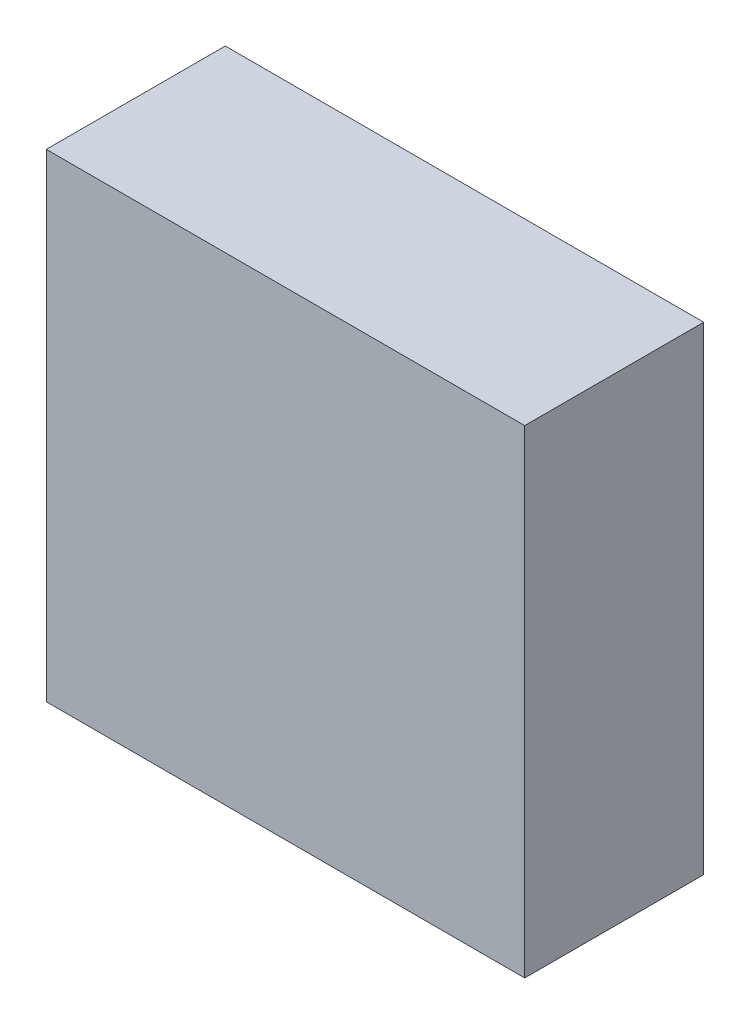
ISO-10303-21;
HEADER;
FILE_DESCRIPTION(('STEP AP214'),'2;1');
FILE_NAME('part.step','',(''),(''),'','','');
FILE_SCHEMA(('AUTOMOTIVE_DESIGN { 1 0 10303 214 1 1 1 1 }'));
ENDSEC;
DATA;
#1=APPLICATION_CONTEXT('core data for automotive mechanical design processes');
#2=APPLICATION_PROTOCOL_DEFINITION('international standard','automotive_design',2000,#1);
#3=PRODUCT_CONTEXT('',#1,'mechanical');
#4=PRODUCT('Part','Part','',(#3));
#5=PRODUCT_RELATED_PRODUCT_CATEGORY('part','',(#4));
#6=PRODUCT_DEFINITION_FORMATION('','',#4);
#7=PRODUCT_DEFINITION_CONTEXT('part definition',#1,'design');
#8=PRODUCT_DEFINITION('design','',#6,#7);
#9=PRODUCT_DEFINITION_SHAPE('','',#8);
#10=(LENGTH_UNIT() NAMED_UNIT(*) SI_UNIT(.MILLI.,.METRE.));
#11=(NAMED_UNIT(*) PLANE_ANGLE_UNIT() SI_UNIT($,.RADIAN.));
#12=(NAMED_UNIT(*) SI_UNIT($,.STERADIAN.) SOLID_ANGLE_UNIT());
#13=UNCERTAINTY_MEASURE_WITH_UNIT(LENGTH_MEASURE(1.E-05),#10,'distance_accuracy_value','');
#14=(GEOMETRIC_REPRESENTATION_CONTEXT(3) GLOBAL_UNCERTAINTY_ASSIGNED_CONTEXT((#13)) GLOBAL_UNIT_ASSIGNED_CONTEXT((#10,
#11,#12)) REPRESENTATION_CONTEXT('',''));
#15=CARTESIAN_POINT('',(0.,0.,0.));
#16=DIRECTION('',(0.,0.,1.));
#17=DIRECTION('',(1.,0.,0.));
#18=AXIS2_PLACEMENT_3D('',#15,#16,#17);
#19=CARTESIAN_POINT('',(-0.7349998,-0.7349998,0.5499989));
#20=DIRECTION('',(0.,0.,-1.));
#21=DIRECTION('',(-1.,0.,0.));
#22=AXIS2_PLACEMENT_3D('',#19,#20,#21);
#23=PLANE('',#22);
#24=DIRECTION('',(0.,1.,0.));
#25=VECTOR('',#24,1.);
#26=CARTESIAN_POINT('',(0.7349998,-0.7349998,0.5499989));
#27=LINE('',#26,#25);
#28=CARTESIAN_POINT('',(0.7349998,-0.7349998,0.5499989));
#29=VERTEX_POINT('',#28);
#30=CARTESIAN_POINT('',(0.7349998,0.7349998,0.5499989));
#31=VERTEX_POINT('',#30);
#32=EDGE_CURVE('E55',#29,#31,#27,.T.);
#33=ORIENTED_EDGE('',*,*,#32,.T.);
#34=DIRECTION('',(1.,0.,0.));
#35=VECTOR('',#34,1.);
#36=CARTESIAN_POINT('',(0.7349998,0.7349998,0.5499989));
#37=LINE('',#36,#35);
#38=CARTESIAN_POINT('',(-0.7349998,0.7349998,0.5499989));
#39=VERTEX_POINT('',#38);
#40=EDGE_CURVE('E57',#31,#39,#37,.F.);
#41=ORIENTED_EDGE('',*,*,#40,.T.);
#42=DIRECTION('',(0.,1.,0.));
#43=VECTOR('',#42,1.);
#44=CARTESIAN_POINT('',(-0.7349998,0.7349998,0.5499989));
#45=LINE('',#44,#43);
#46=CARTESIAN_POINT('',(-0.7349998,-0.7349998,0.5499989));
#47=VERTEX_POINT('',#46);
#48=EDGE_CURVE('E20',#39,#47,#45,.F.);
#49=ORIENTED_EDGE('',*,*,#48,.T.);
#50=DIRECTION('',(1.,0.,0.));
#51=VECTOR('',#50,1.);
#52=CARTESIAN_POINT('',(-0.7349998,-0.7349998,0.5499989));
#53=LINE('',#52,#51);
#54=EDGE_CURVE('E80',#47,#29,#53,.T.);
#55=ORIENTED_EDGE('',*,*,#54,.T.);
#56=EDGE_LOOP('',(#33,#41,#49,#55));
#57=FACE_BOUND('',#56,.T.);
#58=ADVANCED_FACE('F17',(#57),#23,.F.);
#59=CARTESIAN_POINT('',(-0.7349998,0.7349998,0.));
#60=DIRECTION('',(1.,0.,0.));
#61=DIRECTION('',(0.,0.,-1.));
#62=AXIS2_PLACEMENT_3D('',#59,#60,#61);
#63=PLANE('',#62);
#64=DIRECTION('',(0.,0.,1.));
#65=VECTOR('',#64,1.);
#66=CARTESIAN_POINT('',(-0.7349998,-0.7349998,0.));
#67=LINE('',#66,#65);
#68=CARTESIAN_POINT('',(-0.7349998,-0.7349998,0.));
#69=VERTEX_POINT('',#68);
#70=EDGE_CURVE('E68',#69,#47,#67,.T.);
#71=ORIENTED_EDGE('',*,*,#70,.T.);
#72=ORIENTED_EDGE('',*,*,#48,.F.);
#73=DIRECTION('',(0.,0.,-1.));
#74=VECTOR('',#73,1.);
#75=CARTESIAN_POINT('',(-0.7349998,0.7349998,0.));
#76=LINE('',#75,#74);
#77=CARTESIAN_POINT('',(-0.7349998,0.7349998,0.));
#78=VERTEX_POINT('',#77);
#79=EDGE_CURVE('E63',#39,#78,#76,.T.);
#80=ORIENTED_EDGE('',*,*,#79,.T.);
#81=DIRECTION('',(0.,1.,0.));
#82=VECTOR('',#81,1.);
#83=CARTESIAN_POINT('',(-0.7349998,-0.7349998,0.));
#84=LINE('',#83,#82);
#85=EDGE_CURVE('E83',#69,#78,#84,.T.);
#86=ORIENTED_EDGE('',*,*,#85,.F.);
#87=EDGE_LOOP('',(#71,#72,#80,#86));
#88=FACE_BOUND('',#87,.T.);
#89=ADVANCED_FACE('F65',(#88),#63,.F.);
#90=CARTESIAN_POINT('',(0.7349998,0.7349998,0.));
#91=DIRECTION('',(0.,-1.,0.));
#92=DIRECTION('',(0.,0.,-1.));
#93=AXIS2_PLACEMENT_3D('',#90,#91,#92);
#94=PLANE('',#93);
#95=ORIENTED_EDGE('',*,*,#79,.F.);
#96=ORIENTED_EDGE('',*,*,#40,.F.);
#97=DIRECTION('',(0.,0.,1.));
#98=VECTOR('',#97,1.);
#99=CARTESIAN_POINT('',(0.7349998,0.7349998,0.));
#100=LINE('',#99,#98);
#101=CARTESIAN_POINT('',(0.7349998,0.7349998,0.));
#102=VERTEX_POINT('',#101);
#103=EDGE_CURVE('E75',#31,#102,#100,.F.);
#104=ORIENTED_EDGE('',*,*,#103,.T.);
#105=DIRECTION('',(-1.,0.,0.));
#106=VECTOR('',#105,1.);
#107=CARTESIAN_POINT('',(-0.7349998,0.7349998,0.));
#108=LINE('',#107,#106);
#109=EDGE_CURVE('E72',#78,#102,#108,.F.);
#110=ORIENTED_EDGE('',*,*,#109,.F.);
#111=EDGE_LOOP('',(#95,#96,#104,#110));
#112=FACE_BOUND('',#111,.T.);
#113=ADVANCED_FACE('F70',(#112),#94,.F.);
#114=CARTESIAN_POINT('',(0.7349998,-0.7349998,0.));
#115=DIRECTION('',(-1.,0.,0.));
#116=DIRECTION('',(0.,0.,1.));
#117=AXIS2_PLACEMENT_3D('',#114,#115,#116);
#118=PLANE('',#117);
#119=ORIENTED_EDGE('',*,*,#103,.F.);
#120=ORIENTED_EDGE('',*,*,#32,.F.);
#121=DIRECTION('',(0.,0.,1.));
#122=VECTOR('',#121,1.);
#123=CARTESIAN_POINT('',(0.7349998,-0.7349998,0.));
#124=LINE('',#123,#122);
#125=CARTESIAN_POINT('',(0.7349998,-0.7349998,0.));
#126=VERTEX_POINT('',#125);
#127=EDGE_CURVE('E35',#29,#126,#124,.F.);
#128=ORIENTED_EDGE('',*,*,#127,.T.);
#129=DIRECTION('',(0.,1.,0.));
#130=VECTOR('',#129,1.);
#131=CARTESIAN_POINT('',(0.7349998,-0.7349998,0.));
#132=LINE('',#131,#130);
#133=EDGE_CURVE('E26',#102,#126,#132,.F.);
#134=ORIENTED_EDGE('',*,*,#133,.F.);
#135=EDGE_LOOP('',(#119,#120,#128,#134));
#136=FACE_BOUND('',#135,.T.);
#137=ADVANCED_FACE('F89',(#136),#118,.F.);
#138=CARTESIAN_POINT('',(-0.7349998,-0.7349998,0.));
#139=DIRECTION('',(0.,1.,0.));
#140=DIRECTION('',(0.,0.,1.));
#141=AXIS2_PLACEMENT_3D('',#138,#139,#140);
#142=PLANE('',#141);
#143=ORIENTED_EDGE('',*,*,#127,.F.);
#144=ORIENTED_EDGE('',*,*,#54,.F.);
#145=ORIENTED_EDGE('',*,*,#70,.F.);
#146=DIRECTION('',(-1.,0.,0.));
#147=VECTOR('',#146,1.);
#148=CARTESIAN_POINT('',(-0.7349998,-0.7349998,0.));
#149=LINE('',#148,#147);
#150=EDGE_CURVE('E11',#126,#69,#149,.T.);
#151=ORIENTED_EDGE('',*,*,#150,.F.);
#152=EDGE_LOOP('',(#143,#144,#145,#151));
#153=FACE_BOUND('',#152,.T.);
#154=ADVANCED_FACE('F91',(#153),#142,.F.);
#155=CARTESIAN_POINT('',(-0.7349998,-0.7349998,0.));
#156=DIRECTION('',(0.,0.,-1.));
#157=DIRECTION('',(-1.,0.,0.));
#158=AXIS2_PLACEMENT_3D('',#155,#156,#157);
#159=PLANE('',#158);
#160=ORIENTED_EDGE('',*,*,#133,.T.);
#161=ORIENTED_EDGE('',*,*,#150,.T.);
#162=ORIENTED_EDGE('',*,*,#85,.T.);
#163=ORIENTED_EDGE('',*,*,#109,.T.);
#164=EDGE_LOOP('',(#160,#161,#162,#163));
#165=FACE_BOUND('',#164,.T.);
#166=ADVANCED_FACE('F88',(#165),#159,.T.);
#167=CLOSED_SHELL('',(#58,#89,#113,#137,#154,#166));
#168=MANIFOLD_SOLID_BREP('B1',#167);
#169=ADVANCED_BREP_SHAPE_REPRESENTATION('',(#18,#168),#14);
#170=SHAPE_DEFINITION_REPRESENTATION(#9,#169);
ENDSEC;
END-ISO-10303-21;
